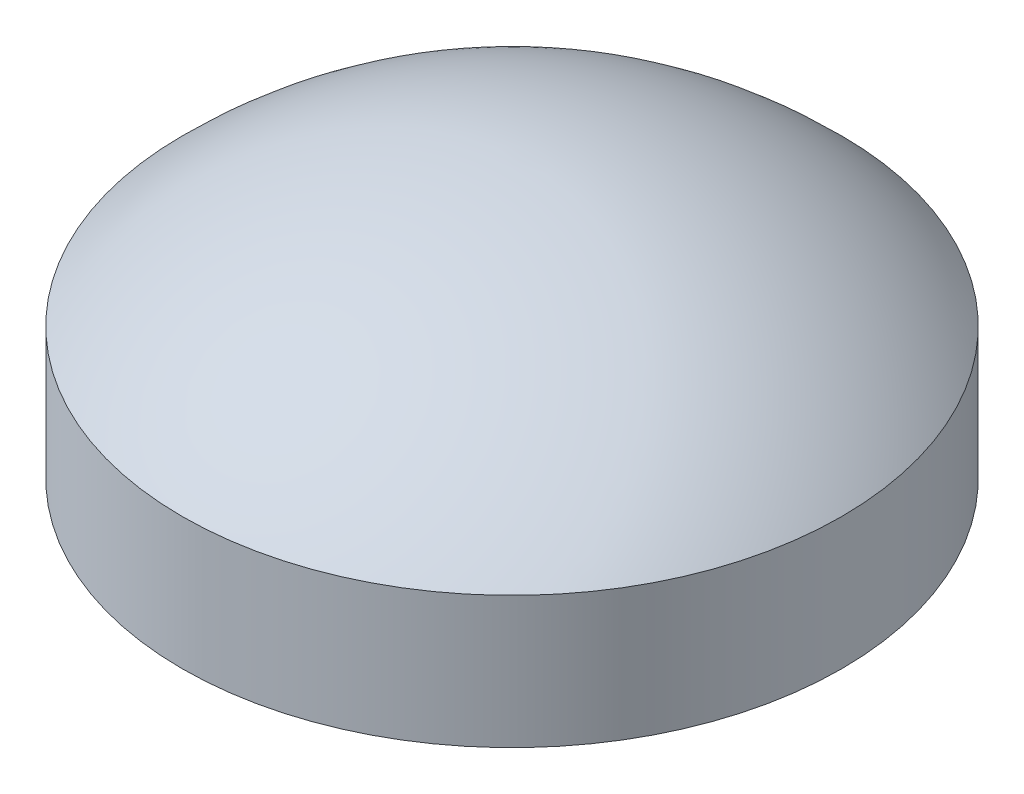
ISO-10303-21;
HEADER;
FILE_DESCRIPTION(('STEP AP214'),'2;1');
FILE_NAME('part.step','',(''),(''),'','','');
FILE_SCHEMA(('AUTOMOTIVE_DESIGN { 1 0 10303 214 1 1 1 1 }'));
ENDSEC;
DATA;
#1=APPLICATION_CONTEXT('core data for automotive mechanical design processes');
#2=APPLICATION_PROTOCOL_DEFINITION('international standard','automotive_design',2000,#1);
#3=PRODUCT_CONTEXT('',#1,'mechanical');
#4=PRODUCT('Part','Part','',(#3));
#5=PRODUCT_RELATED_PRODUCT_CATEGORY('part','',(#4));
#6=PRODUCT_DEFINITION_FORMATION('','',#4);
#7=PRODUCT_DEFINITION_CONTEXT('part definition',#1,'design');
#8=PRODUCT_DEFINITION('design','',#6,#7);
#9=PRODUCT_DEFINITION_SHAPE('','',#8);
#10=(LENGTH_UNIT() NAMED_UNIT(*) SI_UNIT(.MILLI.,.METRE.));
#11=(NAMED_UNIT(*) PLANE_ANGLE_UNIT() SI_UNIT($,.RADIAN.));
#12=(NAMED_UNIT(*) SI_UNIT($,.STERADIAN.) SOLID_ANGLE_UNIT());
#13=UNCERTAINTY_MEASURE_WITH_UNIT(LENGTH_MEASURE(1.E-05),#10,'distance_accuracy_value','');
#14=(GEOMETRIC_REPRESENTATION_CONTEXT(3) GLOBAL_UNCERTAINTY_ASSIGNED_CONTEXT((#13)) GLOBAL_UNIT_ASSIGNED_CONTEXT((#10,
#11,#12)) REPRESENTATION_CONTEXT('',''));
#15=CARTESIAN_POINT('',(0.,0.,0.));
#16=DIRECTION('',(0.,0.,1.));
#17=DIRECTION('',(1.,0.,0.));
#18=AXIS2_PLACEMENT_3D('',#15,#16,#17);
#19=CARTESIAN_POINT('',(-100.,-82.0204102886729,0.));
#20=DIRECTION('',(0.,-1.,0.));
#21=DIRECTION('',(1.,0.,0.));
#22=AXIS2_PLACEMENT_3D('',#19,#20,#21);
#23=PLANE('',#22);
#24=CARTESIAN_POINT('',(2.29351775178237E-13,-82.0204102886726,0.));
#25=DIRECTION('',(0.,1.,0.));
#26=DIRECTION('',(-1.,0.,0.));
#27=AXIS2_PLACEMENT_3D('',#24,#25,#26);
#28=CIRCLE('',#27,97.0000000000002);
#29=CARTESIAN_POINT('',(-97.,-82.0204102886729,0.));
#30=VERTEX_POINT('',#29);
#31=EDGE_CURVE('E10',#30,#30,#28,.T.);
#32=ORIENTED_EDGE('',*,*,#31,.T.);
#33=EDGE_LOOP('',(#32));
#34=FACE_BOUND('',#33,.T.);
#35=CARTESIAN_POINT('',(2.29351775178237E-13,-82.0204102886726,0.));
#36=DIRECTION('',(0.,1.,0.));
#37=DIRECTION('',(-1.,0.,0.));
#38=AXIS2_PLACEMENT_3D('',#35,#36,#37);
#39=CIRCLE('',#38,100.);
#40=CARTESIAN_POINT('',(-100.,-82.0204102886729,0.));
#41=VERTEX_POINT('',#40);
#42=EDGE_CURVE('E54',#41,#41,#39,.T.);
#43=ORIENTED_EDGE('',*,*,#42,.F.);
#44=EDGE_LOOP('',(#43));
#45=FACE_BOUND('',#44,.T.);
#46=ADVANCED_FACE('F37',(#34,#45),#23,.T.);
#47=CARTESIAN_POINT('',(0.,0.,0.));
#48=DIRECTION('',(0.,1.,0.));
#49=DIRECTION('',(-1.,0.,0.));
#50=AXIS2_PLACEMENT_3D('',#47,#48,#49);
#51=CYLINDRICAL_SURFACE('',#50,97.0000000000002);
#52=CARTESIAN_POINT('',(1.20947102944716E-13,-43.2529070204171,0.));
#53=DIRECTION('',(0.,1.,0.));
#54=DIRECTION('',(-1.,0.,0.));
#55=AXIS2_PLACEMENT_3D('',#52,#53,#54);
#56=CIRCLE('',#55,97.0000000000001);
#57=CARTESIAN_POINT('',(-97.,-43.2529070204174,0.));
#58=VERTEX_POINT('',#57);
#59=EDGE_CURVE('E44',#58,#58,#56,.T.);
#60=ORIENTED_EDGE('',*,*,#59,.T.);
#61=EDGE_LOOP('',(#60));
#62=FACE_BOUND('',#61,.T.);
#63=ORIENTED_EDGE('',*,*,#31,.F.);
#64=EDGE_LOOP('',(#63));
#65=FACE_BOUND('',#64,.T.);
#66=ADVANCED_FACE('F65',(#62,#65),#51,.F.);
#67=CARTESIAN_POINT('',(0.,-140.,0.));
#68=DIRECTION('',(0.,1.,0.));
#69=DIRECTION('',(-1.,0.,0.));
#70=AXIS2_PLACEMENT_3D('',#67,#68,#69);
#71=SPHERICAL_SURFACE('',#70,137.);
#72=ORIENTED_EDGE('',*,*,#59,.F.);
#73=EDGE_LOOP('',(#72));
#74=FACE_BOUND('',#73,.T.);
#75=ADVANCED_FACE('F69',(#74),#71,.F.);
#76=CARTESIAN_POINT('',(0.,-140.,0.));
#77=DIRECTION('',(0.,1.,0.));
#78=DIRECTION('',(1.,0.,0.));
#79=AXIS2_PLACEMENT_3D('',#76,#77,#78);
#80=SPHERICAL_SURFACE('',#79,140.);
#81=CARTESIAN_POINT('',(1.17500700856112E-13,-42.0204102886726,0.));
#82=DIRECTION('',(0.,1.,0.));
#83=DIRECTION('',(-1.,0.,0.));
#84=AXIS2_PLACEMENT_3D('',#81,#82,#83);
#85=CIRCLE('',#84,100.);
#86=CARTESIAN_POINT('',(-100.,-42.0204102886729,0.));
#87=VERTEX_POINT('',#86);
#88=EDGE_CURVE('E49',#87,#87,#85,.T.);
#89=ORIENTED_EDGE('',*,*,#88,.T.);
#90=EDGE_LOOP('',(#89));
#91=FACE_BOUND('',#90,.T.);
#92=ADVANCED_FACE('F73',(#91),#80,.T.);
#93=CARTESIAN_POINT('',(0.,0.,0.));
#94=DIRECTION('',(0.,1.,0.));
#95=DIRECTION('',(-1.,0.,0.));
#96=AXIS2_PLACEMENT_3D('',#93,#94,#95);
#97=CYLINDRICAL_SURFACE('',#96,100.);
#98=ORIENTED_EDGE('',*,*,#42,.T.);
#99=EDGE_LOOP('',(#98));
#100=FACE_BOUND('',#99,.T.);
#101=ORIENTED_EDGE('',*,*,#88,.F.);
#102=EDGE_LOOP('',(#101));
#103=FACE_BOUND('',#102,.T.);
#104=ADVANCED_FACE('F61',(#100,#103),#97,.T.);
#105=CLOSED_SHELL('',(#46,#66,#75,#92,#104));
#106=MANIFOLD_SOLID_BREP('B2',#105);
#107=ADVANCED_BREP_SHAPE_REPRESENTATION('',(#18,#106),#14);
#108=SHAPE_DEFINITION_REPRESENTATION(#9,#107);
ENDSEC;
END-ISO-10303-21;
